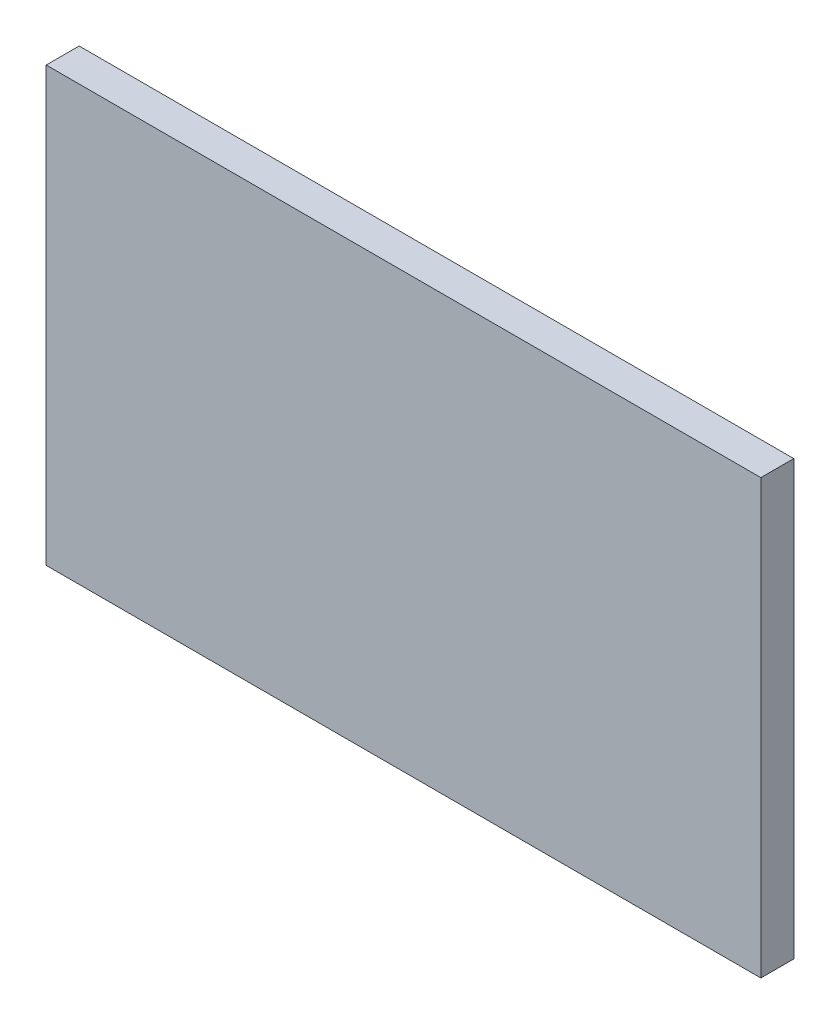
ISO-10303-21;
HEADER;
FILE_DESCRIPTION(('STEP AP214'),'2;1');
FILE_NAME('part.step','',(''),(''),'','','');
FILE_SCHEMA(('AUTOMOTIVE_DESIGN { 1 0 10303 214 1 1 1 1 }'));
ENDSEC;
DATA;
#1=APPLICATION_CONTEXT('core data for automotive mechanical design processes');
#2=APPLICATION_PROTOCOL_DEFINITION('international standard','automotive_design',2000,#1);
#3=PRODUCT_CONTEXT('',#1,'mechanical');
#4=PRODUCT('Part','Part','',(#3));
#5=PRODUCT_RELATED_PRODUCT_CATEGORY('part','',(#4));
#6=PRODUCT_DEFINITION_FORMATION('','',#4);
#7=PRODUCT_DEFINITION_CONTEXT('part definition',#1,'design');
#8=PRODUCT_DEFINITION('design','',#6,#7);
#9=PRODUCT_DEFINITION_SHAPE('','',#8);
#10=(LENGTH_UNIT() NAMED_UNIT(*) SI_UNIT(.MILLI.,.METRE.));
#11=(NAMED_UNIT(*) PLANE_ANGLE_UNIT() SI_UNIT($,.RADIAN.));
#12=(NAMED_UNIT(*) SI_UNIT($,.STERADIAN.) SOLID_ANGLE_UNIT());
#13=UNCERTAINTY_MEASURE_WITH_UNIT(LENGTH_MEASURE(1.E-05),#10,'distance_accuracy_value','');
#14=(GEOMETRIC_REPRESENTATION_CONTEXT(3) GLOBAL_UNCERTAINTY_ASSIGNED_CONTEXT((#13)) GLOBAL_UNIT_ASSIGNED_CONTEXT((#10,
#11,#12)) REPRESENTATION_CONTEXT('',''));
#15=CARTESIAN_POINT('',(0.,0.,0.));
#16=DIRECTION('',(0.,0.,1.));
#17=DIRECTION('',(1.,0.,0.));
#18=AXIS2_PLACEMENT_3D('',#15,#16,#17);
#19=CARTESIAN_POINT('',(0.,0.,7.6));
#20=DIRECTION('',(1.,0.,0.));
#21=DIRECTION('',(0.,0.,-1.));
#22=AXIS2_PLACEMENT_3D('',#19,#20,#21);
#23=PLANE('',#22);
#24=DIRECTION('',(0.,-1.,0.));
#25=VECTOR('',#24,1.);
#26=CARTESIAN_POINT('',(0.,0.,0.));
#27=LINE('',#26,#25);
#28=CARTESIAN_POINT('',(0.,100.,0.));
#29=VERTEX_POINT('',#28);
#30=CARTESIAN_POINT('',(0.,0.,0.));
#31=VERTEX_POINT('',#30);
#32=EDGE_CURVE('E95',#29,#31,#27,.T.);
#33=ORIENTED_EDGE('',*,*,#32,.T.);
#34=DIRECTION('',(0.,0.,-1.));
#35=VECTOR('',#34,1.);
#36=CARTESIAN_POINT('',(0.,0.,7.6));
#37=LINE('',#36,#35);
#38=CARTESIAN_POINT('',(0.,0.,7.6));
#39=VERTEX_POINT('',#38);
#40=EDGE_CURVE('E11',#39,#31,#37,.T.);
#41=ORIENTED_EDGE('',*,*,#40,.F.);
#42=DIRECTION('',(0.,-1.,0.));
#43=VECTOR('',#42,1.);
#44=CARTESIAN_POINT('',(0.,0.,7.6));
#45=LINE('',#44,#43);
#46=CARTESIAN_POINT('',(0.,100.,7.6));
#47=VERTEX_POINT('',#46);
#48=EDGE_CURVE('E83',#47,#39,#45,.T.);
#49=ORIENTED_EDGE('',*,*,#48,.F.);
#50=DIRECTION('',(0.,0.,-1.));
#51=VECTOR('',#50,1.);
#52=CARTESIAN_POINT('',(0.,100.,7.6));
#53=LINE('',#52,#51);
#54=EDGE_CURVE('E91',#47,#29,#53,.T.);
#55=ORIENTED_EDGE('',*,*,#54,.T.);
#56=EDGE_LOOP('',(#33,#41,#49,#55));
#57=FACE_BOUND('',#56,.T.);
#58=ADVANCED_FACE('F32',(#57),#23,.F.);
#59=CARTESIAN_POINT('',(0.,0.,7.6));
#60=DIRECTION('',(0.,1.,0.));
#61=DIRECTION('',(0.,0.,1.));
#62=AXIS2_PLACEMENT_3D('',#59,#60,#61);
#63=PLANE('',#62);
#64=DIRECTION('',(1.,0.,0.));
#65=VECTOR('',#64,1.);
#66=CARTESIAN_POINT('',(0.,0.,0.));
#67=LINE('',#66,#65);
#68=CARTESIAN_POINT('',(164.9,0.,0.));
#69=VERTEX_POINT('',#68);
#70=EDGE_CURVE('E87',#31,#69,#67,.T.);
#71=ORIENTED_EDGE('',*,*,#70,.T.);
#72=DIRECTION('',(0.,0.,-1.));
#73=VECTOR('',#72,1.);
#74=CARTESIAN_POINT('',(164.9,0.,7.6));
#75=LINE('',#74,#73);
#76=CARTESIAN_POINT('',(164.9,0.,7.6));
#77=VERTEX_POINT('',#76);
#78=EDGE_CURVE('E40',#77,#69,#75,.T.);
#79=ORIENTED_EDGE('',*,*,#78,.F.);
#80=DIRECTION('',(1.,0.,0.));
#81=VECTOR('',#80,1.);
#82=CARTESIAN_POINT('',(0.,0.,7.6));
#83=LINE('',#82,#81);
#84=EDGE_CURVE('E78',#39,#77,#83,.T.);
#85=ORIENTED_EDGE('',*,*,#84,.F.);
#86=ORIENTED_EDGE('',*,*,#40,.T.);
#87=EDGE_LOOP('',(#71,#79,#85,#86));
#88=FACE_BOUND('',#87,.T.);
#89=ADVANCED_FACE('F86',(#88),#63,.F.);
#90=CARTESIAN_POINT('',(164.9,0.,7.6));
#91=DIRECTION('',(-1.,0.,0.));
#92=DIRECTION('',(0.,-1.,0.));
#93=AXIS2_PLACEMENT_3D('',#90,#91,#92);
#94=PLANE('',#93);
#95=DIRECTION('',(0.,1.,0.));
#96=VECTOR('',#95,1.);
#97=CARTESIAN_POINT('',(164.9,0.,0.));
#98=LINE('',#97,#96);
#99=CARTESIAN_POINT('',(164.9,100.,0.));
#100=VERTEX_POINT('',#99);
#101=EDGE_CURVE('E65',#69,#100,#98,.T.);
#102=ORIENTED_EDGE('',*,*,#101,.T.);
#103=DIRECTION('',(0.,0.,-1.));
#104=VECTOR('',#103,1.);
#105=CARTESIAN_POINT('',(164.9,100.,7.6));
#106=LINE('',#105,#104);
#107=CARTESIAN_POINT('',(164.9,100.,7.6));
#108=VERTEX_POINT('',#107);
#109=EDGE_CURVE('E88',#108,#100,#106,.T.);
#110=ORIENTED_EDGE('',*,*,#109,.F.);
#111=DIRECTION('',(0.,1.,0.));
#112=VECTOR('',#111,1.);
#113=CARTESIAN_POINT('',(164.9,0.,7.6));
#114=LINE('',#113,#112);
#115=EDGE_CURVE('E81',#77,#108,#114,.T.);
#116=ORIENTED_EDGE('',*,*,#115,.F.);
#117=ORIENTED_EDGE('',*,*,#78,.T.);
#118=EDGE_LOOP('',(#102,#110,#116,#117));
#119=FACE_BOUND('',#118,.T.);
#120=ADVANCED_FACE('F89',(#119),#94,.F.);
#121=CARTESIAN_POINT('',(0.,100.,7.6));
#122=DIRECTION('',(0.,-1.,0.));
#123=DIRECTION('',(0.,0.,-1.));
#124=AXIS2_PLACEMENT_3D('',#121,#122,#123);
#125=PLANE('',#124);
#126=DIRECTION('',(-1.,0.,0.));
#127=VECTOR('',#126,1.);
#128=CARTESIAN_POINT('',(0.,100.,0.));
#129=LINE('',#128,#127);
#130=EDGE_CURVE('E71',#100,#29,#129,.T.);
#131=ORIENTED_EDGE('',*,*,#130,.T.);
#132=ORIENTED_EDGE('',*,*,#54,.F.);
#133=DIRECTION('',(-1.,0.,0.));
#134=VECTOR('',#133,1.);
#135=CARTESIAN_POINT('',(0.,100.,7.6));
#136=LINE('',#135,#134);
#137=EDGE_CURVE('E48',#108,#47,#136,.T.);
#138=ORIENTED_EDGE('',*,*,#137,.F.);
#139=ORIENTED_EDGE('',*,*,#109,.T.);
#140=EDGE_LOOP('',(#131,#132,#138,#139));
#141=FACE_BOUND('',#140,.T.);
#142=ADVANCED_FACE('F102',(#141),#125,.F.);
#143=CARTESIAN_POINT('',(0.,0.,7.6));
#144=DIRECTION('',(0.,0.,-1.));
#145=DIRECTION('',(-1.,0.,0.));
#146=AXIS2_PLACEMENT_3D('',#143,#144,#145);
#147=PLANE('',#146);
#148=ORIENTED_EDGE('',*,*,#48,.T.);
#149=ORIENTED_EDGE('',*,*,#84,.T.);
#150=ORIENTED_EDGE('',*,*,#115,.T.);
#151=ORIENTED_EDGE('',*,*,#137,.T.);
#152=EDGE_LOOP('',(#148,#149,#150,#151));
#153=FACE_BOUND('',#152,.T.);
#154=ADVANCED_FACE('F79',(#153),#147,.F.);
#155=CARTESIAN_POINT('',(0.,0.,0.));
#156=DIRECTION('',(0.,0.,-1.));
#157=DIRECTION('',(-1.,0.,0.));
#158=AXIS2_PLACEMENT_3D('',#155,#156,#157);
#159=PLANE('',#158);
#160=ORIENTED_EDGE('',*,*,#32,.F.);
#161=ORIENTED_EDGE('',*,*,#130,.F.);
#162=ORIENTED_EDGE('',*,*,#101,.F.);
#163=ORIENTED_EDGE('',*,*,#70,.F.);
#164=EDGE_LOOP('',(#160,#161,#162,#163));
#165=FACE_BOUND('',#164,.T.);
#166=ADVANCED_FACE('F105',(#165),#159,.T.);
#167=CLOSED_SHELL('',(#58,#89,#120,#142,#154,#166));
#168=MANIFOLD_SOLID_BREP('B2',#167);
#169=ADVANCED_BREP_SHAPE_REPRESENTATION('',(#18,#168),#14);
#170=SHAPE_DEFINITION_REPRESENTATION(#9,#169);
ENDSEC;
END-ISO-10303-21;
